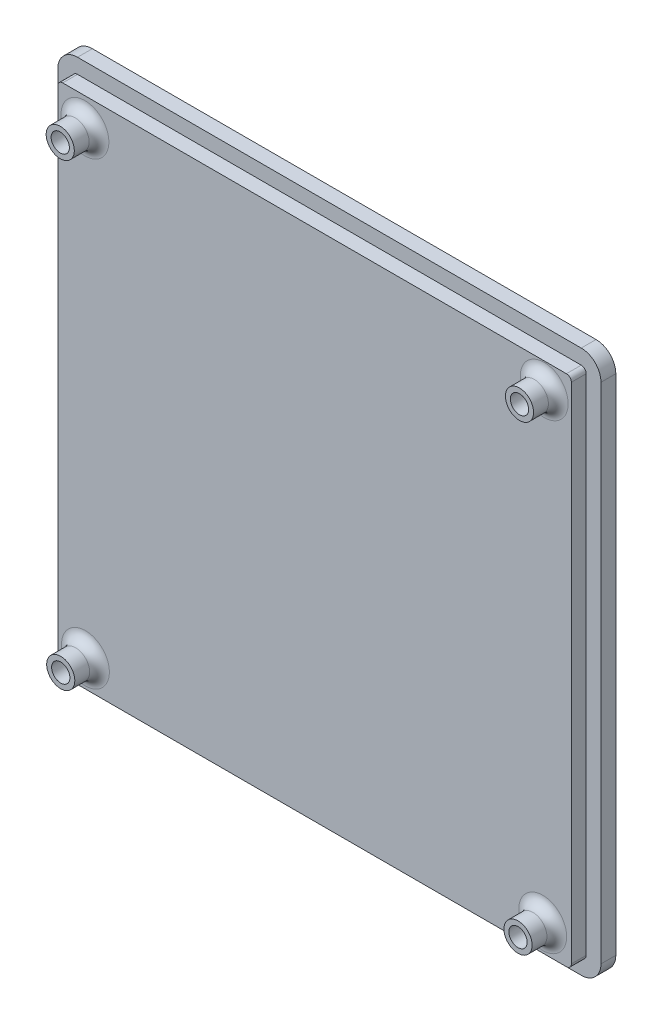
ISO-10303-21;
HEADER;
FILE_DESCRIPTION(('STEP AP214'),'2;1');
FILE_NAME('part.step','',(''),(''),'','','');
FILE_SCHEMA(('AUTOMOTIVE_DESIGN { 1 0 10303 214 1 1 1 1 }'));
ENDSEC;
DATA;
#1=APPLICATION_CONTEXT('core data for automotive mechanical design processes');
#2=APPLICATION_PROTOCOL_DEFINITION('international standard','automotive_design',2000,#1);
#3=PRODUCT_CONTEXT('',#1,'mechanical');
#4=PRODUCT('Part','Part','',(#3));
#5=PRODUCT_RELATED_PRODUCT_CATEGORY('part','',(#4));
#6=PRODUCT_DEFINITION_FORMATION('','',#4);
#7=PRODUCT_DEFINITION_CONTEXT('part definition',#1,'design');
#8=PRODUCT_DEFINITION('design','',#6,#7);
#9=PRODUCT_DEFINITION_SHAPE('','',#8);
#10=(LENGTH_UNIT() NAMED_UNIT(*) SI_UNIT(.MILLI.,.METRE.));
#11=(NAMED_UNIT(*) PLANE_ANGLE_UNIT() SI_UNIT($,.RADIAN.));
#12=(NAMED_UNIT(*) SI_UNIT($,.STERADIAN.) SOLID_ANGLE_UNIT());
#13=UNCERTAINTY_MEASURE_WITH_UNIT(LENGTH_MEASURE(1.E-05),#10,'distance_accuracy_value','');
#14=(GEOMETRIC_REPRESENTATION_CONTEXT(3) GLOBAL_UNCERTAINTY_ASSIGNED_CONTEXT((#13)) GLOBAL_UNIT_ASSIGNED_CONTEXT((#10,
#11,#12)) REPRESENTATION_CONTEXT('',''));
#15=CARTESIAN_POINT('',(0.,0.,0.));
#16=DIRECTION('',(0.,0.,1.));
#17=DIRECTION('',(1.,0.,0.));
#18=AXIS2_PLACEMENT_3D('',#15,#16,#17);
#19=CARTESIAN_POINT('',(-52.,52.,6.));
#20=DIRECTION('',(1.,0.,0.));
#21=DIRECTION('',(0.,1.,0.));
#22=AXIS2_PLACEMENT_3D('',#19,#20,#21);
#23=PLANE('',#22);
#24=DIRECTION('',(0.,1.,0.));
#25=VECTOR('',#24,1.);
#26=CARTESIAN_POINT('',(-52.,-51.,3.));
#27=LINE('',#26,#25);
#28=CARTESIAN_POINT('',(-52.,-51.,3.));
#29=VERTEX_POINT('',#28);
#30=CARTESIAN_POINT('',(-52.,51.,3.));
#31=VERTEX_POINT('',#30);
#32=EDGE_CURVE('E422',#29,#31,#27,.T.);
#33=ORIENTED_EDGE('',*,*,#32,.F.);
#34=DIRECTION('',(0.,0.,-1.));
#35=VECTOR('',#34,1.);
#36=CARTESIAN_POINT('',(-52.,-51.,6.));
#37=LINE('',#36,#35);
#38=CARTESIAN_POINT('',(-52.,-51.,6.));
#39=VERTEX_POINT('',#38);
#40=EDGE_CURVE('E282',#29,#39,#37,.F.);
#41=ORIENTED_EDGE('',*,*,#40,.T.);
#42=DIRECTION('',(0.,-1.,0.));
#43=VECTOR('',#42,1.);
#44=CARTESIAN_POINT('',(-52.,52.,6.));
#45=LINE('',#44,#43);
#46=CARTESIAN_POINT('',(-52.,51.,6.));
#47=VERTEX_POINT('',#46);
#48=EDGE_CURVE('E404',#47,#39,#45,.T.);
#49=ORIENTED_EDGE('',*,*,#48,.F.);
#50=DIRECTION('',(0.,0.,-1.));
#51=VECTOR('',#50,1.);
#52=CARTESIAN_POINT('',(-52.,51.,0.));
#53=LINE('',#52,#51);
#54=EDGE_CURVE('E279',#47,#31,#53,.T.);
#55=ORIENTED_EDGE('',*,*,#54,.T.);
#56=EDGE_LOOP('',(#33,#41,#49,#55));
#57=FACE_BOUND('',#56,.T.);
#58=ADVANCED_FACE('F128',(#57),#23,.F.);
#59=CARTESIAN_POINT('',(-52.,-52.,6.));
#60=DIRECTION('',(0.,1.,0.));
#61=DIRECTION('',(0.,0.,1.));
#62=AXIS2_PLACEMENT_3D('',#59,#60,#61);
#63=PLANE('',#62);
#64=DIRECTION('',(-1.,0.,0.));
#65=VECTOR('',#64,1.);
#66=CARTESIAN_POINT('',(51.,-52.,3.));
#67=LINE('',#66,#65);
#68=CARTESIAN_POINT('',(51.,-52.,3.));
#69=VERTEX_POINT('',#68);
#70=CARTESIAN_POINT('',(-51.,-52.,3.));
#71=VERTEX_POINT('',#70);
#72=EDGE_CURVE('E416',#69,#71,#67,.T.);
#73=ORIENTED_EDGE('',*,*,#72,.F.);
#74=DIRECTION('',(0.,0.,-1.));
#75=VECTOR('',#74,1.);
#76=CARTESIAN_POINT('',(51.,-52.,6.));
#77=LINE('',#76,#75);
#78=CARTESIAN_POINT('',(51.,-52.,6.));
#79=VERTEX_POINT('',#78);
#80=EDGE_CURVE('E270',#69,#79,#77,.F.);
#81=ORIENTED_EDGE('',*,*,#80,.T.);
#82=DIRECTION('',(1.,0.,0.));
#83=VECTOR('',#82,1.);
#84=CARTESIAN_POINT('',(-52.,-52.,6.));
#85=LINE('',#84,#83);
#86=CARTESIAN_POINT('',(-51.,-52.,6.));
#87=VERTEX_POINT('',#86);
#88=EDGE_CURVE('E294',#87,#79,#85,.T.);
#89=ORIENTED_EDGE('',*,*,#88,.F.);
#90=DIRECTION('',(0.,0.,-1.));
#91=VECTOR('',#90,1.);
#92=CARTESIAN_POINT('',(-51.,-52.,6.));
#93=LINE('',#92,#91);
#94=EDGE_CURVE('E261',#87,#71,#93,.T.);
#95=ORIENTED_EDGE('',*,*,#94,.T.);
#96=EDGE_LOOP('',(#73,#81,#89,#95));
#97=FACE_BOUND('',#96,.T.);
#98=ADVANCED_FACE('F335',(#97),#63,.F.);
#99=CARTESIAN_POINT('',(52.,52.,6.));
#100=DIRECTION('',(1.,0.,0.));
#101=DIRECTION('',(0.,1.,0.));
#102=AXIS2_PLACEMENT_3D('',#99,#100,#101);
#103=PLANE('',#102);
#104=DIRECTION('',(0.,0.,-1.));
#105=VECTOR('',#104,1.);
#106=CARTESIAN_POINT('',(52.,-51.,0.));
#107=LINE('',#106,#105);
#108=CARTESIAN_POINT('',(52.,-51.,6.));
#109=VERTEX_POINT('',#108);
#110=CARTESIAN_POINT('',(52.,-51.,3.));
#111=VERTEX_POINT('',#110);
#112=EDGE_CURVE('E256',#109,#111,#107,.T.);
#113=ORIENTED_EDGE('',*,*,#112,.T.);
#114=DIRECTION('',(0.,-1.,0.));
#115=VECTOR('',#114,1.);
#116=CARTESIAN_POINT('',(52.,51.,3.));
#117=LINE('',#116,#115);
#118=CARTESIAN_POINT('',(52.,51.,3.));
#119=VERTEX_POINT('',#118);
#120=EDGE_CURVE('E243',#119,#111,#117,.T.);
#121=ORIENTED_EDGE('',*,*,#120,.F.);
#122=DIRECTION('',(0.,0.,-1.));
#123=VECTOR('',#122,1.);
#124=CARTESIAN_POINT('',(52.,51.,6.));
#125=LINE('',#124,#123);
#126=CARTESIAN_POINT('',(52.,51.,6.));
#127=VERTEX_POINT('',#126);
#128=EDGE_CURVE('E254',#119,#127,#125,.F.);
#129=ORIENTED_EDGE('',*,*,#128,.T.);
#130=DIRECTION('',(0.,-1.,0.));
#131=VECTOR('',#130,1.);
#132=CARTESIAN_POINT('',(52.,52.,6.));
#133=LINE('',#132,#131);
#134=EDGE_CURVE('E289',#127,#109,#133,.T.);
#135=ORIENTED_EDGE('',*,*,#134,.T.);
#136=EDGE_LOOP('',(#113,#121,#129,#135));
#137=FACE_BOUND('',#136,.T.);
#138=ADVANCED_FACE('F252',(#137),#103,.T.);
#139=CARTESIAN_POINT('',(-52.,52.,6.));
#140=DIRECTION('',(0.,1.,0.));
#141=DIRECTION('',(0.,0.,1.));
#142=AXIS2_PLACEMENT_3D('',#139,#140,#141);
#143=PLANE('',#142);
#144=DIRECTION('',(0.,0.,-1.));
#145=VECTOR('',#144,1.);
#146=CARTESIAN_POINT('',(51.,52.,6.));
#147=LINE('',#146,#145);
#148=CARTESIAN_POINT('',(51.,52.,6.));
#149=VERTEX_POINT('',#148);
#150=CARTESIAN_POINT('',(51.,52.,3.));
#151=VERTEX_POINT('',#150);
#152=EDGE_CURVE('E136',#149,#151,#147,.T.);
#153=ORIENTED_EDGE('',*,*,#152,.T.);
#154=DIRECTION('',(1.,0.,0.));
#155=VECTOR('',#154,1.);
#156=CARTESIAN_POINT('',(-51.,52.,3.));
#157=LINE('',#156,#155);
#158=CARTESIAN_POINT('',(-51.,52.,3.));
#159=VERTEX_POINT('',#158);
#160=EDGE_CURVE('E143',#159,#151,#157,.T.);
#161=ORIENTED_EDGE('',*,*,#160,.F.);
#162=DIRECTION('',(0.,0.,-1.));
#163=VECTOR('',#162,1.);
#164=CARTESIAN_POINT('',(-51.,52.,6.));
#165=LINE('',#164,#163);
#166=CARTESIAN_POINT('',(-51.,52.,6.));
#167=VERTEX_POINT('',#166);
#168=EDGE_CURVE('E12',#159,#167,#165,.F.);
#169=ORIENTED_EDGE('',*,*,#168,.T.);
#170=DIRECTION('',(1.,0.,0.));
#171=VECTOR('',#170,1.);
#172=CARTESIAN_POINT('',(-52.,52.,6.));
#173=LINE('',#172,#171);
#174=EDGE_CURVE('E286',#167,#149,#173,.T.);
#175=ORIENTED_EDGE('',*,*,#174,.T.);
#176=EDGE_LOOP('',(#153,#161,#169,#175));
#177=FACE_BOUND('',#176,.T.);
#178=ADVANCED_FACE('F284',(#177),#143,.T.);
#179=CARTESIAN_POINT('',(51.,-51.,6.));
#180=DIRECTION('',(0.,0.,1.));
#181=DIRECTION('',(1.,0.,0.));
#182=AXIS2_PLACEMENT_3D('',#179,#180,#181);
#183=CYLINDRICAL_SURFACE('',#182,1.);
#184=ORIENTED_EDGE('',*,*,#80,.F.);
#185=CARTESIAN_POINT('',(51.,-51.,3.));
#186=DIRECTION('',(0.,0.,-1.));
#187=DIRECTION('',(-1.,0.,0.));
#188=AXIS2_PLACEMENT_3D('',#185,#186,#187);
#189=CIRCLE('',#188,1.);
#190=EDGE_CURVE('E257',#111,#69,#189,.T.);
#191=ORIENTED_EDGE('',*,*,#190,.F.);
#192=ORIENTED_EDGE('',*,*,#112,.F.);
#193=CARTESIAN_POINT('',(51.,-51.,6.));
#194=DIRECTION('',(0.,0.,1.));
#195=DIRECTION('',(1.,0.,0.));
#196=AXIS2_PLACEMENT_3D('',#193,#194,#195);
#197=CIRCLE('',#196,1.);
#198=EDGE_CURVE('E277',#79,#109,#197,.T.);
#199=ORIENTED_EDGE('',*,*,#198,.F.);
#200=EDGE_LOOP('',(#184,#191,#192,#199));
#201=FACE_BOUND('',#200,.T.);
#202=ADVANCED_FACE('F414',(#201),#183,.T.);
#203=CARTESIAN_POINT('',(-51.,-51.,6.));
#204=DIRECTION('',(0.,0.,-1.));
#205=DIRECTION('',(-1.,0.,0.));
#206=AXIS2_PLACEMENT_3D('',#203,#204,#205);
#207=CYLINDRICAL_SURFACE('',#206,1.);
#208=ORIENTED_EDGE('',*,*,#40,.F.);
#209=CARTESIAN_POINT('',(-51.,-51.,3.));
#210=DIRECTION('',(0.,0.,-1.));
#211=DIRECTION('',(-1.,0.,0.));
#212=AXIS2_PLACEMENT_3D('',#209,#210,#211);
#213=CIRCLE('',#212,1.);
#214=EDGE_CURVE('E418',#71,#29,#213,.T.);
#215=ORIENTED_EDGE('',*,*,#214,.F.);
#216=ORIENTED_EDGE('',*,*,#94,.F.);
#217=CARTESIAN_POINT('',(-51.,-51.,6.));
#218=DIRECTION('',(0.,0.,1.));
#219=DIRECTION('',(1.,0.,0.));
#220=AXIS2_PLACEMENT_3D('',#217,#218,#219);
#221=CIRCLE('',#220,1.);
#222=EDGE_CURVE('E275',#39,#87,#221,.T.);
#223=ORIENTED_EDGE('',*,*,#222,.F.);
#224=EDGE_LOOP('',(#208,#215,#216,#223));
#225=FACE_BOUND('',#224,.T.);
#226=ADVANCED_FACE('F599',(#225),#207,.T.);
#227=CARTESIAN_POINT('',(-51.,51.,6.));
#228=DIRECTION('',(0.,0.,1.));
#229=DIRECTION('',(1.,0.,0.));
#230=AXIS2_PLACEMENT_3D('',#227,#228,#229);
#231=CYLINDRICAL_SURFACE('',#230,1.);
#232=ORIENTED_EDGE('',*,*,#168,.F.);
#233=CARTESIAN_POINT('',(-51.,51.,3.));
#234=DIRECTION('',(0.,0.,-1.));
#235=DIRECTION('',(-1.,0.,0.));
#236=AXIS2_PLACEMENT_3D('',#233,#234,#235);
#237=CIRCLE('',#236,1.);
#238=EDGE_CURVE('E424',#31,#159,#237,.T.);
#239=ORIENTED_EDGE('',*,*,#238,.F.);
#240=ORIENTED_EDGE('',*,*,#54,.F.);
#241=CARTESIAN_POINT('',(-51.,51.,6.));
#242=DIRECTION('',(0.,0.,1.));
#243=DIRECTION('',(1.,0.,0.));
#244=AXIS2_PLACEMENT_3D('',#241,#242,#243);
#245=CIRCLE('',#244,1.);
#246=EDGE_CURVE('E273',#167,#47,#245,.T.);
#247=ORIENTED_EDGE('',*,*,#246,.F.);
#248=EDGE_LOOP('',(#232,#239,#240,#247));
#249=FACE_BOUND('',#248,.T.);
#250=ADVANCED_FACE('F606',(#249),#231,.T.);
#251=CARTESIAN_POINT('',(51.,51.,6.));
#252=DIRECTION('',(0.,0.,-1.));
#253=DIRECTION('',(-1.,0.,0.));
#254=AXIS2_PLACEMENT_3D('',#251,#252,#253);
#255=CYLINDRICAL_SURFACE('',#254,1.);
#256=ORIENTED_EDGE('',*,*,#128,.F.);
#257=CARTESIAN_POINT('',(51.,51.,3.));
#258=DIRECTION('',(0.,0.,-1.));
#259=DIRECTION('',(-1.,0.,0.));
#260=AXIS2_PLACEMENT_3D('',#257,#258,#259);
#261=CIRCLE('',#260,1.);
#262=EDGE_CURVE('E239',#151,#119,#261,.T.);
#263=ORIENTED_EDGE('',*,*,#262,.F.);
#264=ORIENTED_EDGE('',*,*,#152,.F.);
#265=CARTESIAN_POINT('',(51.,51.,6.));
#266=DIRECTION('',(0.,0.,1.));
#267=DIRECTION('',(1.,0.,0.));
#268=AXIS2_PLACEMENT_3D('',#265,#266,#267);
#269=CIRCLE('',#268,1.);
#270=EDGE_CURVE('E151',#127,#149,#269,.T.);
#271=ORIENTED_EDGE('',*,*,#270,.F.);
#272=EDGE_LOOP('',(#256,#263,#264,#271));
#273=FACE_BOUND('',#272,.T.);
#274=ADVANCED_FACE('F130',(#273),#255,.T.);
#275=CARTESIAN_POINT('',(0.,0.,6.));
#276=DIRECTION('',(0.,0.,1.));
#277=DIRECTION('',(1.,0.,0.));
#278=AXIS2_PLACEMENT_3D('',#275,#276,#277);
#279=PLANE('',#278);
#280=CARTESIAN_POINT('',(46.2,-46.7,6.));
#281=DIRECTION('',(0.,0.,1.));
#282=DIRECTION('',(1.,0.,0.));
#283=AXIS2_PLACEMENT_3D('',#280,#281,#282);
#284=CIRCLE('',#283,4.85);
#285=CARTESIAN_POINT('',(51.05,-46.7,6.));
#286=VERTEX_POINT('',#285);
#287=EDGE_CURVE('E306',#286,#286,#284,.F.);
#288=ORIENTED_EDGE('',*,*,#287,.T.);
#289=EDGE_LOOP('',(#288));
#290=FACE_BOUND('',#289,.T.);
#291=CARTESIAN_POINT('',(-46.4,-46.6,6.));
#292=DIRECTION('',(0.,0.,1.));
#293=DIRECTION('',(1.,0.,0.));
#294=AXIS2_PLACEMENT_3D('',#291,#292,#293);
#295=CIRCLE('',#294,4.85);
#296=CARTESIAN_POINT('',(-41.55,-46.6,6.));
#297=VERTEX_POINT('',#296);
#298=EDGE_CURVE('E303',#297,#297,#295,.F.);
#299=ORIENTED_EDGE('',*,*,#298,.T.);
#300=EDGE_LOOP('',(#299));
#301=FACE_BOUND('',#300,.T.);
#302=CARTESIAN_POINT('',(-46.5,46.3,6.));
#303=DIRECTION('',(0.,0.,1.));
#304=DIRECTION('',(1.,0.,0.));
#305=AXIS2_PLACEMENT_3D('',#302,#303,#304);
#306=CIRCLE('',#305,4.85);
#307=CARTESIAN_POINT('',(-41.65,46.3,6.));
#308=VERTEX_POINT('',#307);
#309=EDGE_CURVE('E300',#308,#308,#306,.F.);
#310=ORIENTED_EDGE('',*,*,#309,.T.);
#311=EDGE_LOOP('',(#310));
#312=FACE_BOUND('',#311,.T.);
#313=CARTESIAN_POINT('',(46.5,46.9,6.));
#314=DIRECTION('',(0.,0.,1.));
#315=DIRECTION('',(1.,0.,0.));
#316=AXIS2_PLACEMENT_3D('',#313,#314,#315);
#317=CIRCLE('',#316,4.85);
#318=CARTESIAN_POINT('',(51.35,46.9,6.));
#319=VERTEX_POINT('',#318);
#320=EDGE_CURVE('E292',#319,#319,#317,.F.);
#321=ORIENTED_EDGE('',*,*,#320,.T.);
#322=EDGE_LOOP('',(#321));
#323=FACE_BOUND('',#322,.T.);
#324=ORIENTED_EDGE('',*,*,#88,.T.);
#325=ORIENTED_EDGE('',*,*,#198,.T.);
#326=ORIENTED_EDGE('',*,*,#134,.F.);
#327=ORIENTED_EDGE('',*,*,#270,.T.);
#328=ORIENTED_EDGE('',*,*,#174,.F.);
#329=ORIENTED_EDGE('',*,*,#246,.T.);
#330=ORIENTED_EDGE('',*,*,#48,.T.);
#331=ORIENTED_EDGE('',*,*,#222,.T.);
#332=EDGE_LOOP('',(#324,#325,#326,#327,#328,#329,#330,#331));
#333=FACE_BOUND('',#332,.T.);
#334=ADVANCED_FACE('F409',(#290,#301,#312,#323,#333),#279,.T.);
#335=CARTESIAN_POINT('',(0.,0.,0.));
#336=DIRECTION('',(0.,0.,1.));
#337=DIRECTION('',(1.,0.,0.));
#338=AXIS2_PLACEMENT_3D('',#335,#336,#337);
#339=PLANE('',#338);
#340=CARTESIAN_POINT('',(46.5,46.9,0.));
#341=DIRECTION('',(0.,0.,1.));
#342=DIRECTION('',(1.,0.,0.));
#343=AXIS2_PLACEMENT_3D('',#340,#341,#342);
#344=CIRCLE('',#343,1.85);
#345=CARTESIAN_POINT('',(48.35,46.9,0.));
#346=VERTEX_POINT('',#345);
#347=EDGE_CURVE('E401',#346,#346,#344,.T.);
#348=ORIENTED_EDGE('',*,*,#347,.T.);
#349=EDGE_LOOP('',(#348));
#350=FACE_BOUND('',#349,.T.);
#351=CARTESIAN_POINT('',(46.2,-46.7,0.));
#352=DIRECTION('',(0.,0.,1.));
#353=DIRECTION('',(1.,0.,0.));
#354=AXIS2_PLACEMENT_3D('',#351,#352,#353);
#355=CIRCLE('',#354,1.85);
#356=CARTESIAN_POINT('',(48.05,-46.7,0.));
#357=VERTEX_POINT('',#356);
#358=EDGE_CURVE('E398',#357,#357,#355,.T.);
#359=ORIENTED_EDGE('',*,*,#358,.T.);
#360=EDGE_LOOP('',(#359));
#361=FACE_BOUND('',#360,.T.);
#362=CARTESIAN_POINT('',(-46.5,46.3,0.));
#363=DIRECTION('',(0.,0.,1.));
#364=DIRECTION('',(1.,0.,0.));
#365=AXIS2_PLACEMENT_3D('',#362,#363,#364);
#366=CIRCLE('',#365,1.85);
#367=CARTESIAN_POINT('',(-44.65,46.3,0.));
#368=VERTEX_POINT('',#367);
#369=EDGE_CURVE('E395',#368,#368,#366,.T.);
#370=ORIENTED_EDGE('',*,*,#369,.T.);
#371=EDGE_LOOP('',(#370));
#372=FACE_BOUND('',#371,.T.);
#373=CARTESIAN_POINT('',(-46.4,-46.6,0.));
#374=DIRECTION('',(0.,0.,1.));
#375=DIRECTION('',(1.,0.,0.));
#376=AXIS2_PLACEMENT_3D('',#373,#374,#375);
#377=CIRCLE('',#376,1.85);
#378=CARTESIAN_POINT('',(-44.55,-46.6,0.));
#379=VERTEX_POINT('',#378);
#380=EDGE_CURVE('E392',#379,#379,#377,.T.);
#381=ORIENTED_EDGE('',*,*,#380,.T.);
#382=EDGE_LOOP('',(#381));
#383=FACE_BOUND('',#382,.T.);
#384=CARTESIAN_POINT('',(-51.,51.,0.));
#385=DIRECTION('',(0.,0.,-1.));
#386=DIRECTION('',(-1.,0.,0.));
#387=AXIS2_PLACEMENT_3D('',#384,#385,#386);
#388=CIRCLE('',#387,4.);
#389=CARTESIAN_POINT('',(-55.,51.,0.));
#390=VERTEX_POINT('',#389);
#391=CARTESIAN_POINT('',(-51.,55.,0.));
#392=VERTEX_POINT('',#391);
#393=EDGE_CURVE('E427',#390,#392,#388,.T.);
#394=ORIENTED_EDGE('',*,*,#393,.T.);
#395=DIRECTION('',(1.,0.,0.));
#396=VECTOR('',#395,1.);
#397=CARTESIAN_POINT('',(-51.,55.,0.));
#398=LINE('',#397,#396);
#399=CARTESIAN_POINT('',(51.,55.,0.));
#400=VERTEX_POINT('',#399);
#401=EDGE_CURVE('E455',#392,#400,#398,.T.);
#402=ORIENTED_EDGE('',*,*,#401,.T.);
#403=CARTESIAN_POINT('',(51.,51.,0.));
#404=DIRECTION('',(0.,0.,-1.));
#405=DIRECTION('',(-1.,0.,0.));
#406=AXIS2_PLACEMENT_3D('',#403,#404,#405);
#407=CIRCLE('',#406,4.);
#408=CARTESIAN_POINT('',(55.,51.,0.));
#409=VERTEX_POINT('',#408);
#410=EDGE_CURVE('E458',#400,#409,#407,.T.);
#411=ORIENTED_EDGE('',*,*,#410,.T.);
#412=DIRECTION('',(0.,-1.,0.));
#413=VECTOR('',#412,1.);
#414=CARTESIAN_POINT('',(55.,51.,0.));
#415=LINE('',#414,#413);
#416=CARTESIAN_POINT('',(55.,-51.,0.));
#417=VERTEX_POINT('',#416);
#418=EDGE_CURVE('E461',#409,#417,#415,.T.);
#419=ORIENTED_EDGE('',*,*,#418,.T.);
#420=CARTESIAN_POINT('',(51.,-51.,0.));
#421=DIRECTION('',(0.,0.,-1.));
#422=DIRECTION('',(-1.,0.,0.));
#423=AXIS2_PLACEMENT_3D('',#420,#421,#422);
#424=CIRCLE('',#423,3.99999999999999);
#425=CARTESIAN_POINT('',(51.,-55.,0.));
#426=VERTEX_POINT('',#425);
#427=EDGE_CURVE('E464',#417,#426,#424,.T.);
#428=ORIENTED_EDGE('',*,*,#427,.T.);
#429=DIRECTION('',(-1.,0.,0.));
#430=VECTOR('',#429,1.);
#431=CARTESIAN_POINT('',(51.,-55.,0.));
#432=LINE('',#431,#430);
#433=CARTESIAN_POINT('',(-51.,-55.,0.));
#434=VERTEX_POINT('',#433);
#435=EDGE_CURVE('E467',#426,#434,#432,.T.);
#436=ORIENTED_EDGE('',*,*,#435,.T.);
#437=CARTESIAN_POINT('',(-51.,-51.,0.));
#438=DIRECTION('',(0.,0.,-1.));
#439=DIRECTION('',(-1.,0.,0.));
#440=AXIS2_PLACEMENT_3D('',#437,#438,#439);
#441=CIRCLE('',#440,4.);
#442=CARTESIAN_POINT('',(-55.,-51.,0.));
#443=VERTEX_POINT('',#442);
#444=EDGE_CURVE('E470',#434,#443,#441,.T.);
#445=ORIENTED_EDGE('',*,*,#444,.T.);
#446=DIRECTION('',(0.,1.,0.));
#447=VECTOR('',#446,1.);
#448=CARTESIAN_POINT('',(-55.,-51.,0.));
#449=LINE('',#448,#447);
#450=EDGE_CURVE('E432',#443,#390,#449,.T.);
#451=ORIENTED_EDGE('',*,*,#450,.T.);
#452=EDGE_LOOP('',(#394,#402,#411,#419,#428,#436,#445,#451));
#453=FACE_BOUND('',#452,.T.);
#454=ADVANCED_FACE('F493',(#350,#361,#372,#383,#453),#339,.F.);
#455=CARTESIAN_POINT('',(46.5,46.9,6.));
#456=DIRECTION('',(0.,0.,-1.));
#457=DIRECTION('',(-1.,0.,0.));
#458=AXIS2_PLACEMENT_3D('',#455,#456,#457);
#459=CYLINDRICAL_SURFACE('',#458,1.85);
#460=ORIENTED_EDGE('',*,*,#347,.F.);
#461=EDGE_LOOP('',(#460));
#462=FACE_BOUND('',#461,.T.);
#463=CARTESIAN_POINT('',(46.5,46.9,11.));
#464=DIRECTION('',(0.,0.,1.));
#465=DIRECTION('',(1.,0.,0.));
#466=AXIS2_PLACEMENT_3D('',#463,#464,#465);
#467=CIRCLE('',#466,1.85);
#468=CARTESIAN_POINT('',(48.35,46.9,11.));
#469=VERTEX_POINT('',#468);
#470=EDGE_CURVE('E386',#469,#469,#467,.F.);
#471=ORIENTED_EDGE('',*,*,#470,.F.);
#472=EDGE_LOOP('',(#471));
#473=FACE_BOUND('',#472,.T.);
#474=ADVANCED_FACE('F572',(#462,#473),#459,.F.);
#475=CARTESIAN_POINT('',(46.2,-46.7,6.));
#476=DIRECTION('',(0.,0.,-1.));
#477=DIRECTION('',(-1.,0.,0.));
#478=AXIS2_PLACEMENT_3D('',#475,#476,#477);
#479=CYLINDRICAL_SURFACE('',#478,1.85);
#480=ORIENTED_EDGE('',*,*,#358,.F.);
#481=EDGE_LOOP('',(#480));
#482=FACE_BOUND('',#481,.T.);
#483=CARTESIAN_POINT('',(46.2,-46.7,11.));
#484=DIRECTION('',(0.,0.,1.));
#485=DIRECTION('',(1.,0.,0.));
#486=AXIS2_PLACEMENT_3D('',#483,#484,#485);
#487=CIRCLE('',#486,1.85);
#488=CARTESIAN_POINT('',(48.05,-46.7,11.));
#489=VERTEX_POINT('',#488);
#490=EDGE_CURVE('E363',#489,#489,#487,.T.);
#491=ORIENTED_EDGE('',*,*,#490,.T.);
#492=EDGE_LOOP('',(#491));
#493=FACE_BOUND('',#492,.T.);
#494=ADVANCED_FACE('F568',(#482,#493),#479,.F.);
#495=CARTESIAN_POINT('',(-46.5,46.3,6.));
#496=DIRECTION('',(0.,0.,-1.));
#497=DIRECTION('',(-1.,0.,0.));
#498=AXIS2_PLACEMENT_3D('',#495,#496,#497);
#499=CYLINDRICAL_SURFACE('',#498,1.85);
#500=ORIENTED_EDGE('',*,*,#369,.F.);
#501=EDGE_LOOP('',(#500));
#502=FACE_BOUND('',#501,.T.);
#503=CARTESIAN_POINT('',(-46.5,46.3,11.));
#504=DIRECTION('',(0.,0.,1.));
#505=DIRECTION('',(1.,0.,0.));
#506=AXIS2_PLACEMENT_3D('',#503,#504,#505);
#507=CIRCLE('',#506,1.85);
#508=CARTESIAN_POINT('',(-44.65,46.3,11.));
#509=VERTEX_POINT('',#508);
#510=EDGE_CURVE('E383',#509,#509,#507,.T.);
#511=ORIENTED_EDGE('',*,*,#510,.T.);
#512=EDGE_LOOP('',(#511));
#513=FACE_BOUND('',#512,.T.);
#514=ADVANCED_FACE('F564',(#502,#513),#499,.F.);
#515=CARTESIAN_POINT('',(-46.4,-46.6,6.));
#516=DIRECTION('',(0.,0.,-1.));
#517=DIRECTION('',(-1.,0.,0.));
#518=AXIS2_PLACEMENT_3D('',#515,#516,#517);
#519=CYLINDRICAL_SURFACE('',#518,1.85);
#520=ORIENTED_EDGE('',*,*,#380,.F.);
#521=EDGE_LOOP('',(#520));
#522=FACE_BOUND('',#521,.T.);
#523=CARTESIAN_POINT('',(-46.4,-46.6,11.));
#524=DIRECTION('',(0.,0.,1.));
#525=DIRECTION('',(1.,0.,0.));
#526=AXIS2_PLACEMENT_3D('',#523,#524,#525);
#527=CIRCLE('',#526,1.85);
#528=CARTESIAN_POINT('',(-44.55,-46.6,11.));
#529=VERTEX_POINT('',#528);
#530=EDGE_CURVE('E377',#529,#529,#527,.T.);
#531=ORIENTED_EDGE('',*,*,#530,.T.);
#532=EDGE_LOOP('',(#531));
#533=FACE_BOUND('',#532,.T.);
#534=ADVANCED_FACE('F560',(#522,#533),#519,.F.);
#535=CARTESIAN_POINT('',(46.5,46.9,11.));
#536=DIRECTION('',(0.,0.,-1.));
#537=DIRECTION('',(-1.,0.,0.));
#538=AXIS2_PLACEMENT_3D('',#535,#536,#537);
#539=CYLINDRICAL_SURFACE('',#538,2.85);
#540=CARTESIAN_POINT('',(46.5,46.9,8.));
#541=DIRECTION('',(0.,0.,1.));
#542=DIRECTION('',(1.,0.,0.));
#543=AXIS2_PLACEMENT_3D('',#540,#541,#542);
#544=CIRCLE('',#543,2.85);
#545=CARTESIAN_POINT('',(49.35,46.9,8.));
#546=VERTEX_POINT('',#545);
#547=EDGE_CURVE('E259',#546,#546,#544,.T.);
#548=ORIENTED_EDGE('',*,*,#547,.T.);
#549=EDGE_LOOP('',(#548));
#550=FACE_BOUND('',#549,.T.);
#551=CARTESIAN_POINT('',(46.5,46.9,11.));
#552=DIRECTION('',(0.,0.,1.));
#553=DIRECTION('',(1.,0.,0.));
#554=AXIS2_PLACEMENT_3D('',#551,#552,#553);
#555=CIRCLE('',#554,2.85);
#556=CARTESIAN_POINT('',(49.35,46.9,11.));
#557=VERTEX_POINT('',#556);
#558=EDGE_CURVE('E389',#557,#557,#555,.T.);
#559=ORIENTED_EDGE('',*,*,#558,.F.);
#560=EDGE_LOOP('',(#559));
#561=FACE_BOUND('',#560,.T.);
#562=ADVANCED_FACE('F556',(#550,#561),#539,.T.);
#563=CARTESIAN_POINT('',(46.5,46.9,11.));
#564=DIRECTION('',(0.,0.,1.));
#565=DIRECTION('',(1.,0.,0.));
#566=AXIS2_PLACEMENT_3D('',#563,#564,#565);
#567=PLANE('',#566);
#568=ORIENTED_EDGE('',*,*,#470,.T.);
#569=EDGE_LOOP('',(#568));
#570=FACE_BOUND('',#569,.T.);
#571=ORIENTED_EDGE('',*,*,#558,.T.);
#572=EDGE_LOOP('',(#571));
#573=FACE_BOUND('',#572,.T.);
#574=ADVANCED_FACE('F552',(#570,#573),#567,.T.);
#575=CARTESIAN_POINT('',(-46.5,46.3,11.));
#576=DIRECTION('',(0.,0.,1.));
#577=DIRECTION('',(1.,0.,0.));
#578=AXIS2_PLACEMENT_3D('',#575,#576,#577);
#579=PLANE('',#578);
#580=CARTESIAN_POINT('',(-46.5,46.3,11.));
#581=DIRECTION('',(0.,0.,1.));
#582=DIRECTION('',(1.,0.,0.));
#583=AXIS2_PLACEMENT_3D('',#580,#581,#582);
#584=CIRCLE('',#583,2.85);
#585=CARTESIAN_POINT('',(-43.65,46.3,11.));
#586=VERTEX_POINT('',#585);
#587=EDGE_CURVE('E380',#586,#586,#584,.T.);
#588=ORIENTED_EDGE('',*,*,#587,.T.);
#589=EDGE_LOOP('',(#588));
#590=FACE_BOUND('',#589,.T.);
#591=ORIENTED_EDGE('',*,*,#510,.F.);
#592=EDGE_LOOP('',(#591));
#593=FACE_BOUND('',#592,.T.);
#594=ADVANCED_FACE('F549',(#590,#593),#579,.T.);
#595=CARTESIAN_POINT('',(-46.5,46.3,11.));
#596=DIRECTION('',(0.,0.,-1.));
#597=DIRECTION('',(-1.,0.,0.));
#598=AXIS2_PLACEMENT_3D('',#595,#596,#597);
#599=CYLINDRICAL_SURFACE('',#598,2.85);
#600=CARTESIAN_POINT('',(-46.5,46.3,8.));
#601=DIRECTION('',(0.,0.,1.));
#602=DIRECTION('',(1.,0.,0.));
#603=AXIS2_PLACEMENT_3D('',#600,#601,#602);
#604=CIRCLE('',#603,2.85);
#605=CARTESIAN_POINT('',(-43.65,46.3,8.));
#606=VERTEX_POINT('',#605);
#607=EDGE_CURVE('E264',#606,#606,#604,.T.);
#608=ORIENTED_EDGE('',*,*,#607,.T.);
#609=EDGE_LOOP('',(#608));
#610=FACE_BOUND('',#609,.T.);
#611=ORIENTED_EDGE('',*,*,#587,.F.);
#612=EDGE_LOOP('',(#611));
#613=FACE_BOUND('',#612,.T.);
#614=ADVANCED_FACE('F314',(#610,#613),#599,.T.);
#615=CARTESIAN_POINT('',(-46.4,-46.6,11.));
#616=DIRECTION('',(0.,0.,1.));
#617=DIRECTION('',(1.,0.,0.));
#618=AXIS2_PLACEMENT_3D('',#615,#616,#617);
#619=PLANE('',#618);
#620=CARTESIAN_POINT('',(-46.4,-46.6,11.));
#621=DIRECTION('',(0.,0.,1.));
#622=DIRECTION('',(1.,0.,0.));
#623=AXIS2_PLACEMENT_3D('',#620,#621,#622);
#624=CIRCLE('',#623,2.85);
#625=CARTESIAN_POINT('',(-43.55,-46.6,11.));
#626=VERTEX_POINT('',#625);
#627=EDGE_CURVE('E367',#626,#626,#624,.T.);
#628=ORIENTED_EDGE('',*,*,#627,.T.);
#629=EDGE_LOOP('',(#628));
#630=FACE_BOUND('',#629,.T.);
#631=ORIENTED_EDGE('',*,*,#530,.F.);
#632=EDGE_LOOP('',(#631));
#633=FACE_BOUND('',#632,.T.);
#634=ADVANCED_FACE('F542',(#630,#633),#619,.T.);
#635=CARTESIAN_POINT('',(-46.4,-46.6,11.));
#636=DIRECTION('',(0.,0.,-1.));
#637=DIRECTION('',(-1.,0.,0.));
#638=AXIS2_PLACEMENT_3D('',#635,#636,#637);
#639=CYLINDRICAL_SURFACE('',#638,2.85);
#640=CARTESIAN_POINT('',(-46.4,-46.6,8.));
#641=DIRECTION('',(0.,0.,1.));
#642=DIRECTION('',(1.,0.,0.));
#643=AXIS2_PLACEMENT_3D('',#640,#641,#642);
#644=CIRCLE('',#643,2.85);
#645=CARTESIAN_POINT('',(-43.55,-46.6,8.));
#646=VERTEX_POINT('',#645);
#647=EDGE_CURVE('E309',#646,#646,#644,.T.);
#648=ORIENTED_EDGE('',*,*,#647,.T.);
#649=EDGE_LOOP('',(#648));
#650=FACE_BOUND('',#649,.T.);
#651=ORIENTED_EDGE('',*,*,#627,.F.);
#652=EDGE_LOOP('',(#651));
#653=FACE_BOUND('',#652,.T.);
#654=ADVANCED_FACE('F539',(#650,#653),#639,.T.);
#655=CARTESIAN_POINT('',(46.2,-46.7,11.));
#656=DIRECTION('',(0.,0.,1.));
#657=DIRECTION('',(1.,0.,0.));
#658=AXIS2_PLACEMENT_3D('',#655,#656,#657);
#659=PLANE('',#658);
#660=CARTESIAN_POINT('',(46.2,-46.7,11.));
#661=DIRECTION('',(0.,0.,1.));
#662=DIRECTION('',(1.,0.,0.));
#663=AXIS2_PLACEMENT_3D('',#660,#661,#662);
#664=CIRCLE('',#663,2.85);
#665=CARTESIAN_POINT('',(49.05,-46.7,11.));
#666=VERTEX_POINT('',#665);
#667=EDGE_CURVE('E361',#666,#666,#664,.T.);
#668=ORIENTED_EDGE('',*,*,#667,.T.);
#669=EDGE_LOOP('',(#668));
#670=FACE_BOUND('',#669,.T.);
#671=ORIENTED_EDGE('',*,*,#490,.F.);
#672=EDGE_LOOP('',(#671));
#673=FACE_BOUND('',#672,.T.);
#674=ADVANCED_FACE('F352',(#670,#673),#659,.T.);
#675=CARTESIAN_POINT('',(46.2,-46.7,11.));
#676=DIRECTION('',(0.,0.,-1.));
#677=DIRECTION('',(-1.,0.,0.));
#678=AXIS2_PLACEMENT_3D('',#675,#676,#677);
#679=CYLINDRICAL_SURFACE('',#678,2.85);
#680=CARTESIAN_POINT('',(46.2,-46.7,8.));
#681=DIRECTION('',(0.,0.,1.));
#682=DIRECTION('',(1.,0.,0.));
#683=AXIS2_PLACEMENT_3D('',#680,#681,#682);
#684=CIRCLE('',#683,2.85);
#685=CARTESIAN_POINT('',(49.05,-46.7,8.));
#686=VERTEX_POINT('',#685);
#687=EDGE_CURVE('E288',#686,#686,#684,.T.);
#688=ORIENTED_EDGE('',*,*,#687,.T.);
#689=EDGE_LOOP('',(#688));
#690=FACE_BOUND('',#689,.T.);
#691=ORIENTED_EDGE('',*,*,#667,.F.);
#692=EDGE_LOOP('',(#691));
#693=FACE_BOUND('',#692,.T.);
#694=ADVANCED_FACE('F347',(#690,#693),#679,.T.);
#695=CARTESIAN_POINT('',(46.2,-46.7,8.));
#696=DIRECTION('',(0.,0.,1.));
#697=DIRECTION('',(1.,0.,0.));
#698=AXIS2_PLACEMENT_3D('',#695,#696,#697);
#699=TOROIDAL_SURFACE('',#698,4.85,2.);
#700=ORIENTED_EDGE('',*,*,#287,.F.);
#701=EDGE_LOOP('',(#700));
#702=FACE_BOUND('',#701,.T.);
#703=ORIENTED_EDGE('',*,*,#687,.F.);
#704=EDGE_LOOP('',(#703));
#705=FACE_BOUND('',#704,.T.);
#706=ADVANCED_FACE('F330',(#702,#705),#699,.F.);
#707=CARTESIAN_POINT('',(-46.4,-46.6,8.));
#708=DIRECTION('',(0.,0.,1.));
#709=DIRECTION('',(1.,0.,0.));
#710=AXIS2_PLACEMENT_3D('',#707,#708,#709);
#711=TOROIDAL_SURFACE('',#710,4.85,2.);
#712=ORIENTED_EDGE('',*,*,#298,.F.);
#713=EDGE_LOOP('',(#712));
#714=FACE_BOUND('',#713,.T.);
#715=ORIENTED_EDGE('',*,*,#647,.F.);
#716=EDGE_LOOP('',(#715));
#717=FACE_BOUND('',#716,.T.);
#718=ADVANCED_FACE('F320',(#714,#717),#711,.F.);
#719=CARTESIAN_POINT('',(-46.5,46.3,8.));
#720=DIRECTION('',(0.,0.,1.));
#721=DIRECTION('',(1.,0.,0.));
#722=AXIS2_PLACEMENT_3D('',#719,#720,#721);
#723=TOROIDAL_SURFACE('',#722,4.85,2.);
#724=ORIENTED_EDGE('',*,*,#309,.F.);
#725=EDGE_LOOP('',(#724));
#726=FACE_BOUND('',#725,.T.);
#727=ORIENTED_EDGE('',*,*,#607,.F.);
#728=EDGE_LOOP('',(#727));
#729=FACE_BOUND('',#728,.T.);
#730=ADVANCED_FACE('F317',(#726,#729),#723,.F.);
#731=CARTESIAN_POINT('',(46.5,46.9,8.));
#732=DIRECTION('',(0.,0.,1.));
#733=DIRECTION('',(1.,0.,0.));
#734=AXIS2_PLACEMENT_3D('',#731,#732,#733);
#735=TOROIDAL_SURFACE('',#734,4.85,2.);
#736=ORIENTED_EDGE('',*,*,#320,.F.);
#737=EDGE_LOOP('',(#736));
#738=FACE_BOUND('',#737,.T.);
#739=ORIENTED_EDGE('',*,*,#547,.F.);
#740=EDGE_LOOP('',(#739));
#741=FACE_BOUND('',#740,.T.);
#742=ADVANCED_FACE('F319',(#738,#741),#735,.F.);
#743=CARTESIAN_POINT('',(-51.,51.,3.));
#744=DIRECTION('',(0.,0.,-1.));
#745=DIRECTION('',(-1.,0.,0.));
#746=AXIS2_PLACEMENT_3D('',#743,#744,#745);
#747=CYLINDRICAL_SURFACE('',#746,4.);
#748=ORIENTED_EDGE('',*,*,#393,.F.);
#749=DIRECTION('',(0.,0.,-1.));
#750=VECTOR('',#749,1.);
#751=CARTESIAN_POINT('',(-55.,51.,3.));
#752=LINE('',#751,#750);
#753=CARTESIAN_POINT('',(-55.,51.,3.));
#754=VERTEX_POINT('',#753);
#755=EDGE_CURVE('E364',#754,#390,#752,.T.);
#756=ORIENTED_EDGE('',*,*,#755,.F.);
#757=CARTESIAN_POINT('',(-51.,51.,3.));
#758=DIRECTION('',(0.,0.,-1.));
#759=DIRECTION('',(-1.,0.,0.));
#760=AXIS2_PLACEMENT_3D('',#757,#758,#759);
#761=CIRCLE('',#760,4.);
#762=CARTESIAN_POINT('',(-51.,55.,3.));
#763=VERTEX_POINT('',#762);
#764=EDGE_CURVE('E428',#754,#763,#761,.T.);
#765=ORIENTED_EDGE('',*,*,#764,.T.);
#766=DIRECTION('',(0.,0.,-1.));
#767=VECTOR('',#766,1.);
#768=CARTESIAN_POINT('',(-51.,55.,3.));
#769=LINE('',#768,#767);
#770=EDGE_CURVE('E372',#763,#392,#769,.T.);
#771=ORIENTED_EDGE('',*,*,#770,.T.);
#772=EDGE_LOOP('',(#748,#756,#765,#771));
#773=FACE_BOUND('',#772,.T.);
#774=ADVANCED_FACE('F327',(#773),#747,.T.);
#775=CARTESIAN_POINT('',(-55.,-51.,3.));
#776=DIRECTION('',(-1.,0.,0.));
#777=DIRECTION('',(0.,0.,1.));
#778=AXIS2_PLACEMENT_3D('',#775,#776,#777);
#779=PLANE('',#778);
#780=ORIENTED_EDGE('',*,*,#450,.F.);
#781=DIRECTION('',(0.,0.,-1.));
#782=VECTOR('',#781,1.);
#783=CARTESIAN_POINT('',(-55.,-51.,3.));
#784=LINE('',#783,#782);
#785=CARTESIAN_POINT('',(-55.,-51.,3.));
#786=VERTEX_POINT('',#785);
#787=EDGE_CURVE('E369',#786,#443,#784,.T.);
#788=ORIENTED_EDGE('',*,*,#787,.F.);
#789=DIRECTION('',(0.,1.,0.));
#790=VECTOR('',#789,1.);
#791=CARTESIAN_POINT('',(-55.,-51.,3.));
#792=LINE('',#791,#790);
#793=EDGE_CURVE('E450',#786,#754,#792,.T.);
#794=ORIENTED_EDGE('',*,*,#793,.T.);
#795=ORIENTED_EDGE('',*,*,#755,.T.);
#796=EDGE_LOOP('',(#780,#788,#794,#795));
#797=FACE_BOUND('',#796,.T.);
#798=ADVANCED_FACE('F497',(#797),#779,.T.);
#799=CARTESIAN_POINT('',(-51.,-51.,3.));
#800=DIRECTION('',(0.,0.,-1.));
#801=DIRECTION('',(-1.,0.,0.));
#802=AXIS2_PLACEMENT_3D('',#799,#800,#801);
#803=CYLINDRICAL_SURFACE('',#802,4.);
#804=ORIENTED_EDGE('',*,*,#444,.F.);
#805=DIRECTION('',(0.,0.,-1.));
#806=VECTOR('',#805,1.);
#807=CARTESIAN_POINT('',(-51.,-55.,3.));
#808=LINE('',#807,#806);
#809=CARTESIAN_POINT('',(-51.,-55.,3.));
#810=VERTEX_POINT('',#809);
#811=EDGE_CURVE('E476',#810,#434,#808,.T.);
#812=ORIENTED_EDGE('',*,*,#811,.F.);
#813=CARTESIAN_POINT('',(-51.,-51.,3.));
#814=DIRECTION('',(0.,0.,-1.));
#815=DIRECTION('',(-1.,0.,0.));
#816=AXIS2_PLACEMENT_3D('',#813,#814,#815);
#817=CIRCLE('',#816,4.);
#818=EDGE_CURVE('E447',#810,#786,#817,.T.);
#819=ORIENTED_EDGE('',*,*,#818,.T.);
#820=ORIENTED_EDGE('',*,*,#787,.T.);
#821=EDGE_LOOP('',(#804,#812,#819,#820));
#822=FACE_BOUND('',#821,.T.);
#823=ADVANCED_FACE('F516',(#822),#803,.T.);
#824=CARTESIAN_POINT('',(51.,-55.,3.));
#825=DIRECTION('',(0.,-1.,0.));
#826=DIRECTION('',(0.,0.,-1.));
#827=AXIS2_PLACEMENT_3D('',#824,#825,#826);
#828=PLANE('',#827);
#829=ORIENTED_EDGE('',*,*,#435,.F.);
#830=DIRECTION('',(0.,0.,-1.));
#831=VECTOR('',#830,1.);
#832=CARTESIAN_POINT('',(51.,-55.,3.));
#833=LINE('',#832,#831);
#834=CARTESIAN_POINT('',(51.,-55.,3.));
#835=VERTEX_POINT('',#834);
#836=EDGE_CURVE('E478',#835,#426,#833,.T.);
#837=ORIENTED_EDGE('',*,*,#836,.F.);
#838=DIRECTION('',(-1.,0.,0.));
#839=VECTOR('',#838,1.);
#840=CARTESIAN_POINT('',(51.,-55.,3.));
#841=LINE('',#840,#839);
#842=EDGE_CURVE('E444',#835,#810,#841,.T.);
#843=ORIENTED_EDGE('',*,*,#842,.T.);
#844=ORIENTED_EDGE('',*,*,#811,.T.);
#845=EDGE_LOOP('',(#829,#837,#843,#844));
#846=FACE_BOUND('',#845,.T.);
#847=ADVANCED_FACE('F514',(#846),#828,.T.);
#848=CARTESIAN_POINT('',(51.,-51.,3.));
#849=DIRECTION('',(0.,0.,-1.));
#850=DIRECTION('',(-1.,0.,0.));
#851=AXIS2_PLACEMENT_3D('',#848,#849,#850);
#852=CYLINDRICAL_SURFACE('',#851,3.99999999999999);
#853=ORIENTED_EDGE('',*,*,#427,.F.);
#854=DIRECTION('',(0.,0.,-1.));
#855=VECTOR('',#854,1.);
#856=CARTESIAN_POINT('',(55.,-51.,3.));
#857=LINE('',#856,#855);
#858=CARTESIAN_POINT('',(55.,-51.,3.));
#859=VERTEX_POINT('',#858);
#860=EDGE_CURVE('E480',#859,#417,#857,.T.);
#861=ORIENTED_EDGE('',*,*,#860,.F.);
#862=CARTESIAN_POINT('',(51.,-51.,3.));
#863=DIRECTION('',(0.,0.,-1.));
#864=DIRECTION('',(-1.,0.,0.));
#865=AXIS2_PLACEMENT_3D('',#862,#863,#864);
#866=CIRCLE('',#865,3.99999999999999);
#867=EDGE_CURVE('E441',#859,#835,#866,.T.);
#868=ORIENTED_EDGE('',*,*,#867,.T.);
#869=ORIENTED_EDGE('',*,*,#836,.T.);
#870=EDGE_LOOP('',(#853,#861,#868,#869));
#871=FACE_BOUND('',#870,.T.);
#872=ADVANCED_FACE('F510',(#871),#852,.T.);
#873=CARTESIAN_POINT('',(55.,51.,3.));
#874=DIRECTION('',(1.,0.,0.));
#875=DIRECTION('',(0.,1.,0.));
#876=AXIS2_PLACEMENT_3D('',#873,#874,#875);
#877=PLANE('',#876);
#878=ORIENTED_EDGE('',*,*,#418,.F.);
#879=DIRECTION('',(0.,0.,-1.));
#880=VECTOR('',#879,1.);
#881=CARTESIAN_POINT('',(55.,51.,3.));
#882=LINE('',#881,#880);
#883=CARTESIAN_POINT('',(55.,51.,3.));
#884=VERTEX_POINT('',#883);
#885=EDGE_CURVE('E482',#884,#409,#882,.T.);
#886=ORIENTED_EDGE('',*,*,#885,.F.);
#887=DIRECTION('',(0.,-1.,0.));
#888=VECTOR('',#887,1.);
#889=CARTESIAN_POINT('',(55.,51.,3.));
#890=LINE('',#889,#888);
#891=EDGE_CURVE('E438',#884,#859,#890,.T.);
#892=ORIENTED_EDGE('',*,*,#891,.T.);
#893=ORIENTED_EDGE('',*,*,#860,.T.);
#894=EDGE_LOOP('',(#878,#886,#892,#893));
#895=FACE_BOUND('',#894,.T.);
#896=ADVANCED_FACE('F508',(#895),#877,.T.);
#897=CARTESIAN_POINT('',(51.,51.,3.));
#898=DIRECTION('',(0.,0.,-1.));
#899=DIRECTION('',(-1.,0.,0.));
#900=AXIS2_PLACEMENT_3D('',#897,#898,#899);
#901=CYLINDRICAL_SURFACE('',#900,4.);
#902=ORIENTED_EDGE('',*,*,#410,.F.);
#903=DIRECTION('',(0.,0.,-1.));
#904=VECTOR('',#903,1.);
#905=CARTESIAN_POINT('',(51.,55.,3.));
#906=LINE('',#905,#904);
#907=CARTESIAN_POINT('',(51.,55.,3.));
#908=VERTEX_POINT('',#907);
#909=EDGE_CURVE('E483',#908,#400,#906,.T.);
#910=ORIENTED_EDGE('',*,*,#909,.F.);
#911=CARTESIAN_POINT('',(51.,51.,3.));
#912=DIRECTION('',(0.,0.,-1.));
#913=DIRECTION('',(-1.,0.,0.));
#914=AXIS2_PLACEMENT_3D('',#911,#912,#913);
#915=CIRCLE('',#914,4.);
#916=EDGE_CURVE('E435',#908,#884,#915,.T.);
#917=ORIENTED_EDGE('',*,*,#916,.T.);
#918=ORIENTED_EDGE('',*,*,#885,.T.);
#919=EDGE_LOOP('',(#902,#910,#917,#918));
#920=FACE_BOUND('',#919,.T.);
#921=ADVANCED_FACE('F504',(#920),#901,.T.);
#922=CARTESIAN_POINT('',(-51.,55.,3.));
#923=DIRECTION('',(0.,1.,0.));
#924=DIRECTION('',(-1.,0.,0.));
#925=AXIS2_PLACEMENT_3D('',#922,#923,#924);
#926=PLANE('',#925);
#927=ORIENTED_EDGE('',*,*,#401,.F.);
#928=ORIENTED_EDGE('',*,*,#770,.F.);
#929=DIRECTION('',(1.,0.,0.));
#930=VECTOR('',#929,1.);
#931=CARTESIAN_POINT('',(-51.,55.,3.));
#932=LINE('',#931,#930);
#933=EDGE_CURVE('E431',#763,#908,#932,.T.);
#934=ORIENTED_EDGE('',*,*,#933,.T.);
#935=ORIENTED_EDGE('',*,*,#909,.T.);
#936=EDGE_LOOP('',(#927,#928,#934,#935));
#937=FACE_BOUND('',#936,.T.);
#938=ADVANCED_FACE('F491',(#937),#926,.T.);
#939=CARTESIAN_POINT('',(-51.,51.,3.));
#940=DIRECTION('',(0.,0.,-1.));
#941=DIRECTION('',(-1.,0.,0.));
#942=AXIS2_PLACEMENT_3D('',#939,#940,#941);
#943=PLANE('',#942);
#944=ORIENTED_EDGE('',*,*,#160,.T.);
#945=ORIENTED_EDGE('',*,*,#262,.T.);
#946=ORIENTED_EDGE('',*,*,#120,.T.);
#947=ORIENTED_EDGE('',*,*,#190,.T.);
#948=ORIENTED_EDGE('',*,*,#72,.T.);
#949=ORIENTED_EDGE('',*,*,#214,.T.);
#950=ORIENTED_EDGE('',*,*,#32,.T.);
#951=ORIENTED_EDGE('',*,*,#238,.T.);
#952=EDGE_LOOP('',(#944,#945,#946,#947,#948,#949,#950,#951));
#953=FACE_BOUND('',#952,.T.);
#954=ORIENTED_EDGE('',*,*,#764,.F.);
#955=ORIENTED_EDGE('',*,*,#793,.F.);
#956=ORIENTED_EDGE('',*,*,#818,.F.);
#957=ORIENTED_EDGE('',*,*,#842,.F.);
#958=ORIENTED_EDGE('',*,*,#867,.F.);
#959=ORIENTED_EDGE('',*,*,#891,.F.);
#960=ORIENTED_EDGE('',*,*,#916,.F.);
#961=ORIENTED_EDGE('',*,*,#933,.F.);
#962=EDGE_LOOP('',(#954,#955,#956,#957,#958,#959,#960,#961));
#963=FACE_BOUND('',#962,.T.);
#964=ADVANCED_FACE('F241',(#953,#963),#943,.F.);
#965=CLOSED_SHELL('',(#58,#98,#138,#178,#202,#226,#250,#274,#334,#454,#474,#494,#514,#534,#562,
#574,#594,#614,#634,#654,#674,#694,#706,#718,#730,#742,#774,#798,#823,#847,#872,#896,#921,#938,#964));
#966=MANIFOLD_SOLID_BREP('B2',#965);
#967=ADVANCED_BREP_SHAPE_REPRESENTATION('',(#18,#966),#14);
#968=SHAPE_DEFINITION_REPRESENTATION(#9,#967);
ENDSEC;
END-ISO-10303-21;
